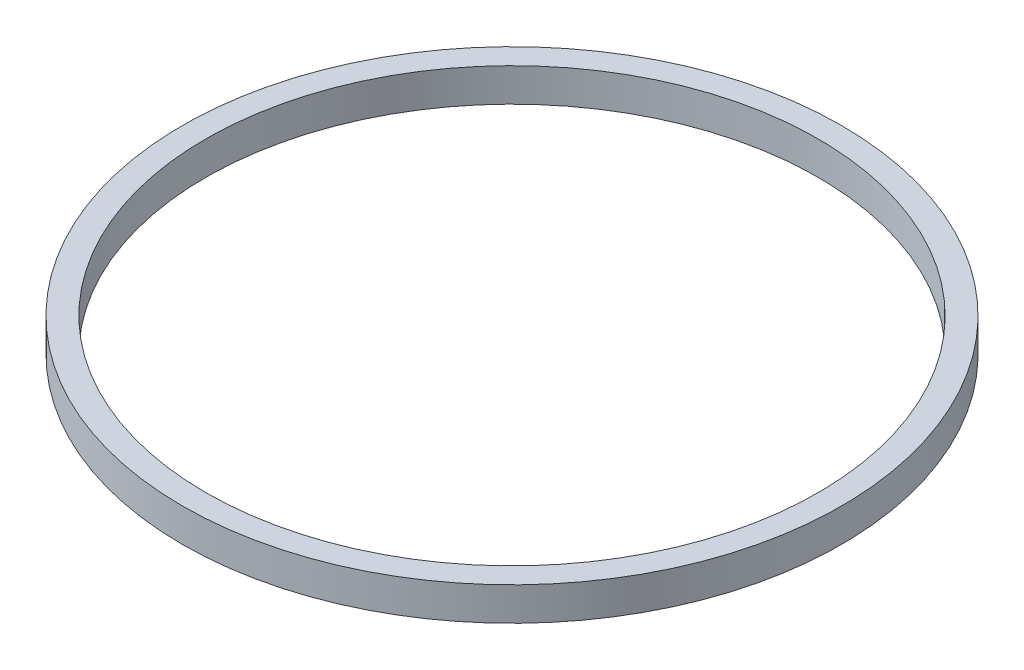
ISO-10303-21;
HEADER;
FILE_DESCRIPTION(('STEP AP214'),'2;1');
FILE_NAME('part.step','',(''),(''),'','','');
FILE_SCHEMA(('AUTOMOTIVE_DESIGN { 1 0 10303 214 1 1 1 1 }'));
ENDSEC;
DATA;
#1=APPLICATION_CONTEXT('core data for automotive mechanical design processes');
#2=APPLICATION_PROTOCOL_DEFINITION('international standard','automotive_design',2000,#1);
#3=PRODUCT_CONTEXT('',#1,'mechanical');
#4=PRODUCT('Part','Part','',(#3));
#5=PRODUCT_RELATED_PRODUCT_CATEGORY('part','',(#4));
#6=PRODUCT_DEFINITION_FORMATION('','',#4);
#7=PRODUCT_DEFINITION_CONTEXT('part definition',#1,'design');
#8=PRODUCT_DEFINITION('design','',#6,#7);
#9=PRODUCT_DEFINITION_SHAPE('','',#8);
#10=(LENGTH_UNIT() NAMED_UNIT(*) SI_UNIT(.MILLI.,.METRE.));
#11=(NAMED_UNIT(*) PLANE_ANGLE_UNIT() SI_UNIT($,.RADIAN.));
#12=(NAMED_UNIT(*) SI_UNIT($,.STERADIAN.) SOLID_ANGLE_UNIT());
#13=UNCERTAINTY_MEASURE_WITH_UNIT(LENGTH_MEASURE(1.E-05),#10,'distance_accuracy_value','');
#14=(GEOMETRIC_REPRESENTATION_CONTEXT(3) GLOBAL_UNCERTAINTY_ASSIGNED_CONTEXT((#13)) GLOBAL_UNIT_ASSIGNED_CONTEXT((#10,
#11,#12)) REPRESENTATION_CONTEXT('',''));
#15=CARTESIAN_POINT('',(0.,0.,0.));
#16=DIRECTION('',(0.,0.,1.));
#17=DIRECTION('',(1.,0.,0.));
#18=AXIS2_PLACEMENT_3D('',#15,#16,#17);
#19=CARTESIAN_POINT('',(0.,109.22,0.));
#20=DIRECTION('',(0.,1.,0.));
#21=DIRECTION('',(0.,0.,1.));
#22=AXIS2_PLACEMENT_3D('',#19,#20,#21);
#23=PLANE('',#22);
#24=CARTESIAN_POINT('',(0.,109.22,0.));
#25=DIRECTION('',(0.,1.,0.));
#26=DIRECTION('',(0.,0.,1.));
#27=AXIS2_PLACEMENT_3D('',#24,#25,#26);
#28=CIRCLE('',#27,1079.5);
#29=CARTESIAN_POINT('',(0.,109.22,1079.5));
#30=VERTEX_POINT('',#29);
#31=EDGE_CURVE('E10',#30,#30,#28,.T.);
#32=ORIENTED_EDGE('',*,*,#31,.T.);
#33=EDGE_LOOP('',(#32));
#34=FACE_BOUND('',#33,.T.);
#35=CARTESIAN_POINT('',(0.,109.22,0.));
#36=DIRECTION('',(0.,1.,0.));
#37=DIRECTION('',(0.,0.,1.));
#38=AXIS2_PLACEMENT_3D('',#35,#36,#37);
#39=CIRCLE('',#38,1003.3);
#40=CARTESIAN_POINT('',(0.,109.22,1003.3));
#41=VERTEX_POINT('',#40);
#42=EDGE_CURVE('E45',#41,#41,#39,.T.);
#43=ORIENTED_EDGE('',*,*,#42,.F.);
#44=EDGE_LOOP('',(#43));
#45=FACE_BOUND('',#44,.T.);
#46=ADVANCED_FACE('F34',(#34,#45),#23,.T.);
#47=CARTESIAN_POINT('',(0.,0.,0.));
#48=DIRECTION('',(0.,1.,0.));
#49=DIRECTION('',(0.,0.,1.));
#50=AXIS2_PLACEMENT_3D('',#47,#48,#49);
#51=PLANE('',#50);
#52=CARTESIAN_POINT('',(0.,0.,0.));
#53=DIRECTION('',(0.,1.,0.));
#54=DIRECTION('',(0.,0.,1.));
#55=AXIS2_PLACEMENT_3D('',#52,#53,#54);
#56=CIRCLE('',#55,1079.5);
#57=CARTESIAN_POINT('',(0.,0.,1079.5));
#58=VERTEX_POINT('',#57);
#59=EDGE_CURVE('E38',#58,#58,#56,.T.);
#60=ORIENTED_EDGE('',*,*,#59,.F.);
#61=EDGE_LOOP('',(#60));
#62=FACE_BOUND('',#61,.T.);
#63=CARTESIAN_POINT('',(0.,0.,0.));
#64=DIRECTION('',(0.,1.,0.));
#65=DIRECTION('',(0.,0.,1.));
#66=AXIS2_PLACEMENT_3D('',#63,#64,#65);
#67=CIRCLE('',#66,1003.3);
#68=CARTESIAN_POINT('',(0.,0.,1003.3));
#69=VERTEX_POINT('',#68);
#70=EDGE_CURVE('E47',#69,#69,#67,.T.);
#71=ORIENTED_EDGE('',*,*,#70,.T.);
#72=EDGE_LOOP('',(#71));
#73=FACE_BOUND('',#72,.T.);
#74=ADVANCED_FACE('F57',(#62,#73),#51,.F.);
#75=CARTESIAN_POINT('',(0.,109.22,0.));
#76=DIRECTION('',(0.,-1.,0.));
#77=DIRECTION('',(0.,0.,-1.));
#78=AXIS2_PLACEMENT_3D('',#75,#76,#77);
#79=CYLINDRICAL_SURFACE('',#78,1079.5);
#80=ORIENTED_EDGE('',*,*,#31,.F.);
#81=EDGE_LOOP('',(#80));
#82=FACE_BOUND('',#81,.T.);
#83=ORIENTED_EDGE('',*,*,#59,.T.);
#84=EDGE_LOOP('',(#83));
#85=FACE_BOUND('',#84,.T.);
#86=ADVANCED_FACE('F36',(#82,#85),#79,.T.);
#87=CARTESIAN_POINT('',(0.,109.22,0.));
#88=DIRECTION('',(0.,-1.,0.));
#89=DIRECTION('',(0.,0.,-1.));
#90=AXIS2_PLACEMENT_3D('',#87,#88,#89);
#91=CYLINDRICAL_SURFACE('',#90,1003.3);
#92=ORIENTED_EDGE('',*,*,#42,.T.);
#93=EDGE_LOOP('',(#92));
#94=FACE_BOUND('',#93,.T.);
#95=ORIENTED_EDGE('',*,*,#70,.F.);
#96=EDGE_LOOP('',(#95));
#97=FACE_BOUND('',#96,.T.);
#98=ADVANCED_FACE('F53',(#94,#97),#91,.F.);
#99=CLOSED_SHELL('',(#46,#74,#86,#98));
#100=MANIFOLD_SOLID_BREP('B2',#99);
#101=ADVANCED_BREP_SHAPE_REPRESENTATION('',(#18,#100),#14);
#102=SHAPE_DEFINITION_REPRESENTATION(#9,#101);
ENDSEC;
END-ISO-10303-21;
